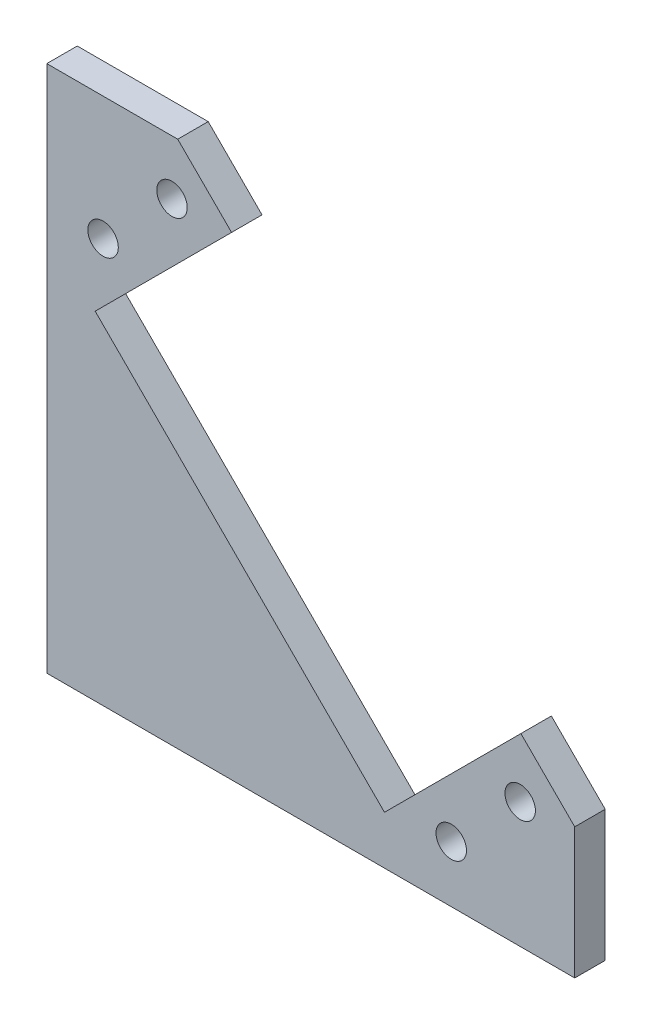
ISO-10303-21;
HEADER;
FILE_DESCRIPTION(('STEP AP214'),'2;1');
FILE_NAME('part.step','',(''),(''),'','','');
FILE_SCHEMA(('AUTOMOTIVE_DESIGN { 1 0 10303 214 1 1 1 1 }'));
ENDSEC;
DATA;
#1=APPLICATION_CONTEXT('core data for automotive mechanical design processes');
#2=APPLICATION_PROTOCOL_DEFINITION('international standard','automotive_design',2000,#1);
#3=PRODUCT_CONTEXT('',#1,'mechanical');
#4=PRODUCT('Part','Part','',(#3));
#5=PRODUCT_RELATED_PRODUCT_CATEGORY('part','',(#4));
#6=PRODUCT_DEFINITION_FORMATION('','',#4);
#7=PRODUCT_DEFINITION_CONTEXT('part definition',#1,'design');
#8=PRODUCT_DEFINITION('design','',#6,#7);
#9=PRODUCT_DEFINITION_SHAPE('','',#8);
#10=(LENGTH_UNIT() NAMED_UNIT(*) SI_UNIT(.MILLI.,.METRE.));
#11=(NAMED_UNIT(*) PLANE_ANGLE_UNIT() SI_UNIT($,.RADIAN.));
#12=(NAMED_UNIT(*) SI_UNIT($,.STERADIAN.) SOLID_ANGLE_UNIT());
#13=UNCERTAINTY_MEASURE_WITH_UNIT(LENGTH_MEASURE(1.E-05),#10,'distance_accuracy_value','');
#14=(GEOMETRIC_REPRESENTATION_CONTEXT(3) GLOBAL_UNCERTAINTY_ASSIGNED_CONTEXT((#13)) GLOBAL_UNIT_ASSIGNED_CONTEXT((#10,
#11,#12)) REPRESENTATION_CONTEXT('',''));
#15=CARTESIAN_POINT('',(0.,0.,0.));
#16=DIRECTION('',(0.,0.,1.));
#17=DIRECTION('',(1.,0.,0.));
#18=AXIS2_PLACEMENT_3D('',#15,#16,#17);
#19=CARTESIAN_POINT('',(-14.2482015,14.2482015,3.));
#20=DIRECTION('',(0.707106781186547,-0.707106781186548,0.));
#21=DIRECTION('',(0.707106781186548,0.707106781186547,0.));
#22=AXIS2_PLACEMENT_3D('',#19,#20,#21);
#23=PLANE('',#22);
#24=DIRECTION('',(-0.707106781186548,-0.707106781186547,0.));
#25=VECTOR('',#24,1.);
#26=CARTESIAN_POINT('',(-14.2482015,14.2482015,0.));
#27=LINE('',#26,#25);
#28=CARTESIAN_POINT('',(18.200296,46.696699,0.));
#29=VERTEX_POINT('',#28);
#30=CARTESIAN_POINT('',(4.76526700000001,33.26167,0.));
#31=VERTEX_POINT('',#30);
#32=EDGE_CURVE('E148',#29,#31,#27,.T.);
#33=ORIENTED_EDGE('',*,*,#32,.F.);
#34=DIRECTION('',(0.,0.,-1.));
#35=VECTOR('',#34,1.);
#36=CARTESIAN_POINT('',(18.200296,46.696699,3.));
#37=LINE('',#36,#35);
#38=CARTESIAN_POINT('',(18.200296,46.696699,3.));
#39=VERTEX_POINT('',#38);
#40=EDGE_CURVE('E11',#39,#29,#37,.T.);
#41=ORIENTED_EDGE('',*,*,#40,.F.);
#42=DIRECTION('',(-0.707106781186548,-0.707106781186547,0.));
#43=VECTOR('',#42,1.);
#44=CARTESIAN_POINT('',(-14.2482015,14.2482015,3.));
#45=LINE('',#44,#43);
#46=CARTESIAN_POINT('',(4.76526700000001,33.26167,3.));
#47=VERTEX_POINT('',#46);
#48=EDGE_CURVE('E200',#39,#47,#45,.T.);
#49=ORIENTED_EDGE('',*,*,#48,.T.);
#50=DIRECTION('',(0.,0.,-1.));
#51=VECTOR('',#50,1.);
#52=CARTESIAN_POINT('',(4.76526700000001,33.26167,3.));
#53=LINE('',#52,#51);
#54=EDGE_CURVE('E87',#47,#31,#53,.T.);
#55=ORIENTED_EDGE('',*,*,#54,.T.);
#56=EDGE_LOOP('',(#33,#41,#49,#55));
#57=FACE_BOUND('',#56,.T.);
#58=ADVANCED_FACE('F32',(#57),#23,.T.);
#59=CARTESIAN_POINT('',(32.4484975,32.4484975,3.));
#60=DIRECTION('',(-0.707106781186547,-0.707106781186547,0.));
#61=DIRECTION('',(0.707106781186548,-0.707106781186548,0.));
#62=AXIS2_PLACEMENT_3D('',#59,#60,#61);
#63=PLANE('',#62);
#64=DIRECTION('',(-0.707106781186548,0.707106781186548,0.));
#65=VECTOR('',#64,1.);
#66=CARTESIAN_POINT('',(32.4484975,32.4484975,0.));
#67=LINE('',#66,#65);
#68=CARTESIAN_POINT('',(12.896995,52.,0.));
#69=VERTEX_POINT('',#68);
#70=EDGE_CURVE('E150',#29,#69,#67,.T.);
#71=ORIENTED_EDGE('',*,*,#70,.T.);
#72=DIRECTION('',(0.,0.,-1.));
#73=VECTOR('',#72,1.);
#74=CARTESIAN_POINT('',(12.896995,52.,3.));
#75=LINE('',#74,#73);
#76=CARTESIAN_POINT('',(12.896995,52.,3.));
#77=VERTEX_POINT('',#76);
#78=EDGE_CURVE('E41',#77,#69,#75,.T.);
#79=ORIENTED_EDGE('',*,*,#78,.F.);
#80=DIRECTION('',(-0.707106781186548,0.707106781186548,0.));
#81=VECTOR('',#80,1.);
#82=CARTESIAN_POINT('',(32.4484975,32.4484975,3.));
#83=LINE('',#82,#81);
#84=EDGE_CURVE('E198',#39,#77,#83,.T.);
#85=ORIENTED_EDGE('',*,*,#84,.F.);
#86=ORIENTED_EDGE('',*,*,#40,.T.);
#87=EDGE_LOOP('',(#71,#79,#85,#86));
#88=FACE_BOUND('',#87,.T.);
#89=ADVANCED_FACE('F188',(#88),#63,.F.);
#90=CARTESIAN_POINT('',(0.,52.,3.));
#91=DIRECTION('',(0.,1.,0.));
#92=DIRECTION('',(0.,0.,1.));
#93=AXIS2_PLACEMENT_3D('',#90,#91,#92);
#94=PLANE('',#93);
#95=DIRECTION('',(1.,0.,0.));
#96=VECTOR('',#95,1.);
#97=CARTESIAN_POINT('',(0.,52.,0.));
#98=LINE('',#97,#96);
#99=CARTESIAN_POINT('',(0.,52.,0.));
#100=VERTEX_POINT('',#99);
#101=EDGE_CURVE('E153',#100,#69,#98,.T.);
#102=ORIENTED_EDGE('',*,*,#101,.F.);
#103=DIRECTION('',(0.,0.,-1.));
#104=VECTOR('',#103,1.);
#105=CARTESIAN_POINT('',(0.,52.,3.));
#106=LINE('',#105,#104);
#107=CARTESIAN_POINT('',(0.,52.,3.));
#108=VERTEX_POINT('',#107);
#109=EDGE_CURVE('E178',#108,#100,#106,.T.);
#110=ORIENTED_EDGE('',*,*,#109,.F.);
#111=DIRECTION('',(1.,0.,0.));
#112=VECTOR('',#111,1.);
#113=CARTESIAN_POINT('',(0.,52.,3.));
#114=LINE('',#113,#112);
#115=EDGE_CURVE('E185',#108,#77,#114,.T.);
#116=ORIENTED_EDGE('',*,*,#115,.T.);
#117=ORIENTED_EDGE('',*,*,#78,.T.);
#118=EDGE_LOOP('',(#102,#110,#116,#117));
#119=FACE_BOUND('',#118,.T.);
#120=ADVANCED_FACE('F183',(#119),#94,.T.);
#121=CARTESIAN_POINT('',(0.,0.,3.));
#122=DIRECTION('',(1.,0.,0.));
#123=DIRECTION('',(0.,0.,-1.));
#124=AXIS2_PLACEMENT_3D('',#121,#122,#123);
#125=PLANE('',#124);
#126=DIRECTION('',(0.,-1.,0.));
#127=VECTOR('',#126,1.);
#128=CARTESIAN_POINT('',(0.,0.,0.));
#129=LINE('',#128,#127);
#130=CARTESIAN_POINT('',(0.,0.,0.));
#131=VERTEX_POINT('',#130);
#132=EDGE_CURVE('E156',#100,#131,#129,.T.);
#133=ORIENTED_EDGE('',*,*,#132,.T.);
#134=DIRECTION('',(0.,0.,-1.));
#135=VECTOR('',#134,1.);
#136=CARTESIAN_POINT('',(0.,0.,3.));
#137=LINE('',#136,#135);
#138=CARTESIAN_POINT('',(0.,0.,3.));
#139=VERTEX_POINT('',#138);
#140=EDGE_CURVE('E175',#139,#131,#137,.T.);
#141=ORIENTED_EDGE('',*,*,#140,.F.);
#142=DIRECTION('',(0.,-1.,0.));
#143=VECTOR('',#142,1.);
#144=CARTESIAN_POINT('',(0.,0.,3.));
#145=LINE('',#144,#143);
#146=EDGE_CURVE('E196',#108,#139,#145,.T.);
#147=ORIENTED_EDGE('',*,*,#146,.F.);
#148=ORIENTED_EDGE('',*,*,#109,.T.);
#149=EDGE_LOOP('',(#133,#141,#147,#148));
#150=FACE_BOUND('',#149,.T.);
#151=ADVANCED_FACE('F193',(#150),#125,.F.);
#152=CARTESIAN_POINT('',(0.,0.,3.));
#153=DIRECTION('',(0.,1.,0.));
#154=DIRECTION('',(0.,0.,1.));
#155=AXIS2_PLACEMENT_3D('',#152,#153,#154);
#156=PLANE('',#155);
#157=DIRECTION('',(1.,0.,0.));
#158=VECTOR('',#157,1.);
#159=CARTESIAN_POINT('',(0.,0.,0.));
#160=LINE('',#159,#158);
#161=CARTESIAN_POINT('',(52.,0.,0.));
#162=VERTEX_POINT('',#161);
#163=EDGE_CURVE('E159',#131,#162,#160,.T.);
#164=ORIENTED_EDGE('',*,*,#163,.T.);
#165=DIRECTION('',(0.,0.,-1.));
#166=VECTOR('',#165,1.);
#167=CARTESIAN_POINT('',(52.,0.,3.));
#168=LINE('',#167,#166);
#169=CARTESIAN_POINT('',(52.,0.,3.));
#170=VERTEX_POINT('',#169);
#171=EDGE_CURVE('E173',#170,#162,#168,.T.);
#172=ORIENTED_EDGE('',*,*,#171,.F.);
#173=DIRECTION('',(1.,0.,0.));
#174=VECTOR('',#173,1.);
#175=CARTESIAN_POINT('',(0.,0.,3.));
#176=LINE('',#175,#174);
#177=EDGE_CURVE('E131',#139,#170,#176,.T.);
#178=ORIENTED_EDGE('',*,*,#177,.F.);
#179=ORIENTED_EDGE('',*,*,#140,.T.);
#180=EDGE_LOOP('',(#164,#172,#178,#179));
#181=FACE_BOUND('',#180,.T.);
#182=ADVANCED_FACE('F205',(#181),#156,.F.);
#183=CARTESIAN_POINT('',(52.,0.,3.));
#184=DIRECTION('',(1.,0.,0.));
#185=DIRECTION('',(0.,0.,-1.));
#186=AXIS2_PLACEMENT_3D('',#183,#184,#185);
#187=PLANE('',#186);
#188=DIRECTION('',(0.,-1.,0.));
#189=VECTOR('',#188,1.);
#190=CARTESIAN_POINT('',(52.,0.,0.));
#191=LINE('',#190,#189);
#192=CARTESIAN_POINT('',(52.,12.896995,0.));
#193=VERTEX_POINT('',#192);
#194=EDGE_CURVE('E162',#193,#162,#191,.T.);
#195=ORIENTED_EDGE('',*,*,#194,.F.);
#196=DIRECTION('',(0.,0.,-1.));
#197=VECTOR('',#196,1.);
#198=CARTESIAN_POINT('',(52.,12.896995,3.));
#199=LINE('',#198,#197);
#200=CARTESIAN_POINT('',(52.,12.896995,3.));
#201=VERTEX_POINT('',#200);
#202=EDGE_CURVE('E119',#201,#193,#199,.T.);
#203=ORIENTED_EDGE('',*,*,#202,.F.);
#204=DIRECTION('',(0.,-1.,0.));
#205=VECTOR('',#204,1.);
#206=CARTESIAN_POINT('',(52.,0.,3.));
#207=LINE('',#206,#205);
#208=EDGE_CURVE('E129',#201,#170,#207,.T.);
#209=ORIENTED_EDGE('',*,*,#208,.T.);
#210=ORIENTED_EDGE('',*,*,#171,.T.);
#211=EDGE_LOOP('',(#195,#203,#209,#210));
#212=FACE_BOUND('',#211,.T.);
#213=ADVANCED_FACE('F208',(#212),#187,.T.);
#214=CARTESIAN_POINT('',(32.4484975,32.4484975,3.));
#215=DIRECTION('',(0.707106781186547,0.707106781186547,0.));
#216=DIRECTION('',(-0.707106781186548,0.707106781186548,0.));
#217=AXIS2_PLACEMENT_3D('',#214,#215,#216);
#218=PLANE('',#217);
#219=DIRECTION('',(0.707106781186548,-0.707106781186548,0.));
#220=VECTOR('',#219,1.);
#221=CARTESIAN_POINT('',(32.4484975,32.4484975,0.));
#222=LINE('',#221,#220);
#223=CARTESIAN_POINT('',(46.696699,18.200296,0.));
#224=VERTEX_POINT('',#223);
#225=EDGE_CURVE('E116',#224,#193,#222,.T.);
#226=ORIENTED_EDGE('',*,*,#225,.F.);
#227=DIRECTION('',(0.,0.,-1.));
#228=VECTOR('',#227,1.);
#229=CARTESIAN_POINT('',(46.696699,18.200296,3.));
#230=LINE('',#229,#228);
#231=CARTESIAN_POINT('',(46.696699,18.200296,3.));
#232=VERTEX_POINT('',#231);
#233=EDGE_CURVE('E110',#232,#224,#230,.T.);
#234=ORIENTED_EDGE('',*,*,#233,.F.);
#235=DIRECTION('',(0.707106781186548,-0.707106781186548,0.));
#236=VECTOR('',#235,1.);
#237=CARTESIAN_POINT('',(32.4484975,32.4484975,3.));
#238=LINE('',#237,#236);
#239=EDGE_CURVE('E114',#232,#201,#238,.T.);
#240=ORIENTED_EDGE('',*,*,#239,.T.);
#241=ORIENTED_EDGE('',*,*,#202,.T.);
#242=EDGE_LOOP('',(#226,#234,#240,#241));
#243=FACE_BOUND('',#242,.T.);
#244=ADVANCED_FACE('F112',(#243),#218,.T.);
#245=CARTESIAN_POINT('',(14.2482015,-14.2482015,3.));
#246=DIRECTION('',(0.707106781186548,-0.707106781186547,0.));
#247=DIRECTION('',(0.707106781186547,0.707106781186548,0.));
#248=AXIS2_PLACEMENT_3D('',#245,#246,#247);
#249=PLANE('',#248);
#250=DIRECTION('',(-0.707106781186547,-0.707106781186548,0.));
#251=VECTOR('',#250,1.);
#252=CARTESIAN_POINT('',(14.2482015,-14.2482015,0.));
#253=LINE('',#252,#251);
#254=CARTESIAN_POINT('',(33.26167,4.76526699999999,0.));
#255=VERTEX_POINT('',#254);
#256=EDGE_CURVE('E166',#224,#255,#253,.T.);
#257=ORIENTED_EDGE('',*,*,#256,.T.);
#258=DIRECTION('',(0.,0.,-1.));
#259=VECTOR('',#258,1.);
#260=CARTESIAN_POINT('',(33.26167,4.76526699999999,3.));
#261=LINE('',#260,#259);
#262=CARTESIAN_POINT('',(33.26167,4.76526699999999,3.));
#263=VERTEX_POINT('',#262);
#264=EDGE_CURVE('E120',#263,#255,#261,.T.);
#265=ORIENTED_EDGE('',*,*,#264,.F.);
#266=DIRECTION('',(-0.707106781186547,-0.707106781186548,0.));
#267=VECTOR('',#266,1.);
#268=CARTESIAN_POINT('',(14.2482015,-14.2482015,3.));
#269=LINE('',#268,#267);
#270=EDGE_CURVE('E123',#232,#263,#269,.T.);
#271=ORIENTED_EDGE('',*,*,#270,.F.);
#272=ORIENTED_EDGE('',*,*,#233,.T.);
#273=EDGE_LOOP('',(#257,#265,#271,#272));
#274=FACE_BOUND('',#273,.T.);
#275=ADVANCED_FACE('F124',(#274),#249,.F.);
#276=CARTESIAN_POINT('',(5.543084,39.837763,3.));
#277=DIRECTION('',(0.,0.,-1.));
#278=DIRECTION('',(-1.,0.,0.));
#279=AXIS2_PLACEMENT_3D('',#276,#277,#278);
#280=CYLINDRICAL_SURFACE('',#279,1.5);
#281=CARTESIAN_POINT('',(5.543084,39.837763,3.));
#282=DIRECTION('',(0.,0.,1.));
#283=DIRECTION('',(1.,0.,0.));
#284=AXIS2_PLACEMENT_3D('',#281,#282,#283);
#285=CIRCLE('',#284,1.5);
#286=CARTESIAN_POINT('',(7.043084,39.837763,3.));
#287=VERTEX_POINT('',#286);
#288=EDGE_CURVE('E350',#287,#287,#285,.T.);
#289=ORIENTED_EDGE('',*,*,#288,.T.);
#290=EDGE_LOOP('',(#289));
#291=FACE_BOUND('',#290,.T.);
#292=CARTESIAN_POINT('',(5.543084,39.837763,0.));
#293=DIRECTION('',(0.,0.,1.));
#294=DIRECTION('',(1.,0.,0.));
#295=AXIS2_PLACEMENT_3D('',#292,#293,#294);
#296=CIRCLE('',#295,1.5);
#297=CARTESIAN_POINT('',(7.043084,39.837763,0.));
#298=VERTEX_POINT('',#297);
#299=EDGE_CURVE('E145',#298,#298,#296,.T.);
#300=ORIENTED_EDGE('',*,*,#299,.F.);
#301=EDGE_LOOP('',(#300));
#302=FACE_BOUND('',#301,.T.);
#303=ADVANCED_FACE('F225',(#291,#302),#280,.F.);
#304=CARTESIAN_POINT('',(12.33131,46.625988,3.));
#305=DIRECTION('',(0.,0.,-1.));
#306=DIRECTION('',(-1.,0.,0.));
#307=AXIS2_PLACEMENT_3D('',#304,#305,#306);
#308=CYLINDRICAL_SURFACE('',#307,1.5);
#309=CARTESIAN_POINT('',(12.33131,46.625988,3.));
#310=DIRECTION('',(0.,0.,1.));
#311=DIRECTION('',(1.,0.,0.));
#312=AXIS2_PLACEMENT_3D('',#309,#310,#311);
#313=CIRCLE('',#312,1.5);
#314=CARTESIAN_POINT('',(13.83131,46.625988,3.));
#315=VERTEX_POINT('',#314);
#316=EDGE_CURVE('E352',#315,#315,#313,.T.);
#317=ORIENTED_EDGE('',*,*,#316,.T.);
#318=EDGE_LOOP('',(#317));
#319=FACE_BOUND('',#318,.T.);
#320=CARTESIAN_POINT('',(12.33131,46.625988,0.));
#321=DIRECTION('',(0.,0.,1.));
#322=DIRECTION('',(1.,0.,0.));
#323=AXIS2_PLACEMENT_3D('',#320,#321,#322);
#324=CIRCLE('',#323,1.5);
#325=CARTESIAN_POINT('',(13.83131,46.625988,0.));
#326=VERTEX_POINT('',#325);
#327=EDGE_CURVE('E142',#326,#326,#324,.T.);
#328=ORIENTED_EDGE('',*,*,#327,.F.);
#329=EDGE_LOOP('',(#328));
#330=FACE_BOUND('',#329,.T.);
#331=ADVANCED_FACE('F228',(#319,#330),#308,.F.);
#332=CARTESIAN_POINT('',(46.625988,12.33131,3.));
#333=DIRECTION('',(0.,0.,-1.));
#334=DIRECTION('',(-1.,0.,0.));
#335=AXIS2_PLACEMENT_3D('',#332,#333,#334);
#336=CYLINDRICAL_SURFACE('',#335,1.5);
#337=CARTESIAN_POINT('',(46.625988,12.33131,3.));
#338=DIRECTION('',(0.,0.,1.));
#339=DIRECTION('',(1.,0.,0.));
#340=AXIS2_PLACEMENT_3D('',#337,#338,#339);
#341=CIRCLE('',#340,1.5);
#342=CARTESIAN_POINT('',(48.125988,12.33131,3.));
#343=VERTEX_POINT('',#342);
#344=EDGE_CURVE('E243',#343,#343,#341,.T.);
#345=ORIENTED_EDGE('',*,*,#344,.T.);
#346=EDGE_LOOP('',(#345));
#347=FACE_BOUND('',#346,.T.);
#348=CARTESIAN_POINT('',(46.625988,12.33131,0.));
#349=DIRECTION('',(0.,0.,1.));
#350=DIRECTION('',(1.,0.,0.));
#351=AXIS2_PLACEMENT_3D('',#348,#349,#350);
#352=CIRCLE('',#351,1.5);
#353=CARTESIAN_POINT('',(48.125988,12.33131,0.));
#354=VERTEX_POINT('',#353);
#355=EDGE_CURVE('E139',#354,#354,#352,.T.);
#356=ORIENTED_EDGE('',*,*,#355,.F.);
#357=EDGE_LOOP('',(#356));
#358=FACE_BOUND('',#357,.T.);
#359=ADVANCED_FACE('F231',(#347,#358),#336,.F.);
#360=CARTESIAN_POINT('',(39.837763,5.54308399999998,3.));
#361=DIRECTION('',(0.,0.,-1.));
#362=DIRECTION('',(-1.,0.,0.));
#363=AXIS2_PLACEMENT_3D('',#360,#361,#362);
#364=CYLINDRICAL_SURFACE('',#363,1.5);
#365=CARTESIAN_POINT('',(39.837763,5.54308399999998,3.));
#366=DIRECTION('',(0.,0.,1.));
#367=DIRECTION('',(1.,0.,0.));
#368=AXIS2_PLACEMENT_3D('',#365,#366,#367);
#369=CIRCLE('',#368,1.5);
#370=CARTESIAN_POINT('',(41.337763,5.54308399999998,3.));
#371=VERTEX_POINT('',#370);
#372=EDGE_CURVE('E169',#371,#371,#369,.T.);
#373=ORIENTED_EDGE('',*,*,#372,.T.);
#374=EDGE_LOOP('',(#373));
#375=FACE_BOUND('',#374,.T.);
#376=CARTESIAN_POINT('',(39.837763,5.54308399999998,0.));
#377=DIRECTION('',(0.,0.,1.));
#378=DIRECTION('',(1.,0.,0.));
#379=AXIS2_PLACEMENT_3D('',#376,#377,#378);
#380=CIRCLE('',#379,1.5);
#381=CARTESIAN_POINT('',(41.337763,5.54308399999998,0.));
#382=VERTEX_POINT('',#381);
#383=EDGE_CURVE('E136',#382,#382,#380,.T.);
#384=ORIENTED_EDGE('',*,*,#383,.F.);
#385=EDGE_LOOP('',(#384));
#386=FACE_BOUND('',#385,.T.);
#387=ADVANCED_FACE('F34',(#375,#386),#364,.F.);
#388=CARTESIAN_POINT('',(19.0134685,19.0134685,3.));
#389=DIRECTION('',(-0.707106781186548,-0.707106781186547,0.));
#390=DIRECTION('',(0.707106781186547,-0.707106781186548,0.));
#391=AXIS2_PLACEMENT_3D('',#388,#389,#390);
#392=PLANE('',#391);
#393=DIRECTION('',(-0.707106781186547,0.707106781186548,0.));
#394=VECTOR('',#393,1.);
#395=CARTESIAN_POINT('',(19.0134685,19.0134685,0.));
#396=LINE('',#395,#394);
#397=EDGE_CURVE('E80',#255,#31,#396,.T.);
#398=ORIENTED_EDGE('',*,*,#397,.T.);
#399=ORIENTED_EDGE('',*,*,#54,.F.);
#400=DIRECTION('',(-0.707106781186547,0.707106781186548,0.));
#401=VECTOR('',#400,1.);
#402=CARTESIAN_POINT('',(19.0134685,19.0134685,3.));
#403=LINE('',#402,#401);
#404=EDGE_CURVE('E49',#263,#47,#403,.T.);
#405=ORIENTED_EDGE('',*,*,#404,.F.);
#406=ORIENTED_EDGE('',*,*,#264,.T.);
#407=EDGE_LOOP('',(#398,#399,#405,#406));
#408=FACE_BOUND('',#407,.T.);
#409=ADVANCED_FACE('F238',(#408),#392,.F.);
#410=CARTESIAN_POINT('',(0.,0.,3.));
#411=DIRECTION('',(0.,0.,1.));
#412=DIRECTION('',(1.,0.,0.));
#413=AXIS2_PLACEMENT_3D('',#410,#411,#412);
#414=PLANE('',#413);
#415=ORIENTED_EDGE('',*,*,#372,.F.);
#416=EDGE_LOOP('',(#415));
#417=FACE_BOUND('',#416,.T.);
#418=ORIENTED_EDGE('',*,*,#344,.F.);
#419=EDGE_LOOP('',(#418));
#420=FACE_BOUND('',#419,.T.);
#421=ORIENTED_EDGE('',*,*,#316,.F.);
#422=EDGE_LOOP('',(#421));
#423=FACE_BOUND('',#422,.T.);
#424=ORIENTED_EDGE('',*,*,#288,.F.);
#425=EDGE_LOOP('',(#424));
#426=FACE_BOUND('',#425,.T.);
#427=ORIENTED_EDGE('',*,*,#48,.F.);
#428=ORIENTED_EDGE('',*,*,#84,.T.);
#429=ORIENTED_EDGE('',*,*,#115,.F.);
#430=ORIENTED_EDGE('',*,*,#146,.T.);
#431=ORIENTED_EDGE('',*,*,#177,.T.);
#432=ORIENTED_EDGE('',*,*,#208,.F.);
#433=ORIENTED_EDGE('',*,*,#239,.F.);
#434=ORIENTED_EDGE('',*,*,#270,.T.);
#435=ORIENTED_EDGE('',*,*,#404,.T.);
#436=EDGE_LOOP('',(#427,#428,#429,#430,#431,#432,#433,#434,#435));
#437=FACE_BOUND('',#436,.T.);
#438=ADVANCED_FACE('F127',(#417,#420,#423,#426,#437),#414,.T.);
#439=CARTESIAN_POINT('',(0.,0.,0.));
#440=DIRECTION('',(0.,0.,1.));
#441=DIRECTION('',(1.,0.,0.));
#442=AXIS2_PLACEMENT_3D('',#439,#440,#441);
#443=PLANE('',#442);
#444=ORIENTED_EDGE('',*,*,#383,.T.);
#445=EDGE_LOOP('',(#444));
#446=FACE_BOUND('',#445,.T.);
#447=ORIENTED_EDGE('',*,*,#355,.T.);
#448=EDGE_LOOP('',(#447));
#449=FACE_BOUND('',#448,.T.);
#450=ORIENTED_EDGE('',*,*,#327,.T.);
#451=EDGE_LOOP('',(#450));
#452=FACE_BOUND('',#451,.T.);
#453=ORIENTED_EDGE('',*,*,#299,.T.);
#454=EDGE_LOOP('',(#453));
#455=FACE_BOUND('',#454,.T.);
#456=ORIENTED_EDGE('',*,*,#32,.T.);
#457=ORIENTED_EDGE('',*,*,#397,.F.);
#458=ORIENTED_EDGE('',*,*,#256,.F.);
#459=ORIENTED_EDGE('',*,*,#225,.T.);
#460=ORIENTED_EDGE('',*,*,#194,.T.);
#461=ORIENTED_EDGE('',*,*,#163,.F.);
#462=ORIENTED_EDGE('',*,*,#132,.F.);
#463=ORIENTED_EDGE('',*,*,#101,.T.);
#464=ORIENTED_EDGE('',*,*,#70,.F.);
#465=EDGE_LOOP('',(#456,#457,#458,#459,#460,#461,#462,#463,#464));
#466=FACE_BOUND('',#465,.T.);
#467=ADVANCED_FACE('F190',(#446,#449,#452,#455,#466),#443,.F.);
#468=CLOSED_SHELL('',(#58,#89,#120,#151,#182,#213,#244,#275,#303,#331,#359,#387,#409,#438,#467));
#469=MANIFOLD_SOLID_BREP('B2',#468);
#470=ADVANCED_BREP_SHAPE_REPRESENTATION('',(#18,#469),#14);
#471=SHAPE_DEFINITION_REPRESENTATION(#9,#470);
ENDSEC;
END-ISO-10303-21;
